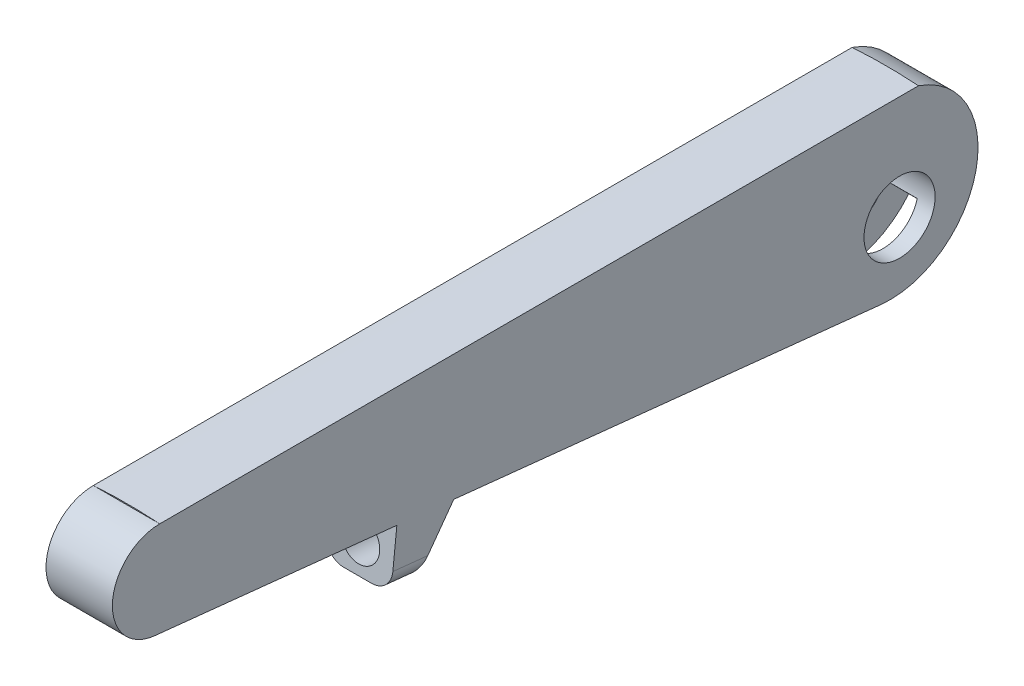
ISO-10303-21;
HEADER;
FILE_DESCRIPTION(('STEP AP214'),'2;1');
FILE_NAME('part.step','',(''),(''),'','','');
FILE_SCHEMA(('AUTOMOTIVE_DESIGN { 1 0 10303 214 1 1 1 1 }'));
ENDSEC;
DATA;
#1=APPLICATION_CONTEXT('core data for automotive mechanical design processes');
#2=APPLICATION_PROTOCOL_DEFINITION('international standard','automotive_design',2000,#1);
#3=PRODUCT_CONTEXT('',#1,'mechanical');
#4=PRODUCT('Part','Part','',(#3));
#5=PRODUCT_RELATED_PRODUCT_CATEGORY('part','',(#4));
#6=PRODUCT_DEFINITION_FORMATION('','',#4);
#7=PRODUCT_DEFINITION_CONTEXT('part definition',#1,'design');
#8=PRODUCT_DEFINITION('design','',#6,#7);
#9=PRODUCT_DEFINITION_SHAPE('','',#8);
#10=(LENGTH_UNIT() NAMED_UNIT(*) SI_UNIT(.MILLI.,.METRE.));
#11=(NAMED_UNIT(*) PLANE_ANGLE_UNIT() SI_UNIT($,.RADIAN.));
#12=(NAMED_UNIT(*) SI_UNIT($,.STERADIAN.) SOLID_ANGLE_UNIT());
#13=UNCERTAINTY_MEASURE_WITH_UNIT(LENGTH_MEASURE(1.E-05),#10,'distance_accuracy_value','');
#14=(GEOMETRIC_REPRESENTATION_CONTEXT(3) GLOBAL_UNCERTAINTY_ASSIGNED_CONTEXT((#13)) GLOBAL_UNIT_ASSIGNED_CONTEXT((#10,
#11,#12)) REPRESENTATION_CONTEXT('',''));
#15=CARTESIAN_POINT('',(0.,0.,0.));
#16=DIRECTION('',(0.,0.,1.));
#17=DIRECTION('',(1.,0.,0.));
#18=AXIS2_PLACEMENT_3D('',#15,#16,#17);
#19=CARTESIAN_POINT('',(-1.75,-6.15847799697525,-1.63160573692912));
#20=DIRECTION('',(0.,0.966650054379797,0.256100902707383));
#21=DIRECTION('',(0.,-0.256100902707383,0.966650054379797));
#22=AXIS2_PLACEMENT_3D('',#19,#20,#21);
#23=PLANE('',#22);
#24=DIRECTION('',(1.,0.,0.));
#25=VECTOR('',#24,1.);
#26=CARTESIAN_POINT('',(-1.75,-14.551376884929,30.0472992598035));
#27=LINE('',#26,#25);
#28=CARTESIAN_POINT('',(-1.75,-14.551376884929,30.0472992598035));
#29=VERTEX_POINT('',#28);
#30=CARTESIAN_POINT('',(1.75,-14.551376884929,30.0472992598035));
#31=VERTEX_POINT('',#30);
#32=EDGE_CURVE('E164',#29,#31,#27,.T.);
#33=ORIENTED_EDGE('',*,*,#32,.F.);
#34=DIRECTION('',(0.,-0.256100902707383,0.966650054379796));
#35=VECTOR('',#34,1.);
#36=CARTESIAN_POINT('',(-1.75,-6.15847799697525,-1.63160573692912));
#37=LINE('',#36,#35);
#38=CARTESIAN_POINT('',(-1.75,-7.37506229607576,2.96037838515269));
#39=VERTEX_POINT('',#38);
#40=EDGE_CURVE('E204',#39,#29,#37,.T.);
#41=ORIENTED_EDGE('',*,*,#40,.F.);
#42=DIRECTION('',(1.,0.,0.));
#43=VECTOR('',#42,1.);
#44=CARTESIAN_POINT('',(-1.75,-7.37506229607576,2.96037838515269));
#45=LINE('',#44,#43);
#46=CARTESIAN_POINT('',(1.75,-7.37506229607576,2.96037838515269));
#47=VERTEX_POINT('',#46);
#48=EDGE_CURVE('E217',#39,#47,#45,.T.);
#49=ORIENTED_EDGE('',*,*,#48,.T.);
#50=DIRECTION('',(0.,-0.256100902707383,0.966650054379796));
#51=VECTOR('',#50,1.);
#52=CARTESIAN_POINT('',(1.75,-6.15847799697525,-1.63160573692912));
#53=LINE('',#52,#51);
#54=EDGE_CURVE('E196',#47,#31,#53,.T.);
#55=ORIENTED_EDGE('',*,*,#54,.T.);
#56=EDGE_LOOP('',(#33,#41,#49,#55));
#57=FACE_BOUND('',#56,.T.);
#58=ADVANCED_FACE('F40',(#57),#23,.F.);
#59=CARTESIAN_POINT('',(-1.75,0.,0.));
#60=DIRECTION('',(1.,0.,0.));
#61=DIRECTION('',(0.,0.,-1.));
#62=AXIS2_PLACEMENT_3D('',#59,#60,#61);
#63=PLANE('',#62);
#64=ORIENTED_EDGE('',*,*,#40,.T.);
#65=DIRECTION('',(0.,0.104528463267647,0.994521895368274));
#66=VECTOR('',#65,1.);
#67=CARTESIAN_POINT('',(-1.75,-17.5159780329542,1.84100347608391));
#68=LINE('',#67,#66);
#69=CARTESIAN_POINT('',(-1.75,-15.9346529062823,16.8863070518606));
#70=VERTEX_POINT('',#69);
#71=EDGE_CURVE('E179',#70,#29,#68,.T.);
#72=ORIENTED_EDGE('',*,*,#71,.F.);
#73=DIRECTION('',(0.,0.994521895368274,-0.104528463267645));
#74=VECTOR('',#73,1.);
#75=CARTESIAN_POINT('',(-1.75,1.58132512667183,15.0453035757767));
#76=LINE('',#75,#74);
#77=CARTESIAN_POINT('',(-1.75,-16.6346529062823,16.9598800165466));
#78=VERTEX_POINT('',#77);
#79=EDGE_CURVE('E169',#78,#70,#76,.T.);
#80=ORIENTED_EDGE('',*,*,#79,.F.);
#81=DIRECTION('',(0.,-0.104528463267647,-0.994521895368274));
#82=VECTOR('',#81,1.);
#83=CARTESIAN_POINT('',(-1.75,-18.2159780329542,1.91457644076988));
#84=LINE('',#83,#82);
#85=CARTESIAN_POINT('',(-1.75,-18.,3.96947016040192));
#86=VERTEX_POINT('',#85);
#87=EDGE_CURVE('E193',#78,#86,#84,.T.);
#88=ORIENTED_EDGE('',*,*,#87,.T.);
#89=CARTESIAN_POINT('',(-1.75,-8.77610756644194,3.));
#90=DIRECTION('',(1.,0.,0.));
#91=DIRECTION('',(0.,0.,-1.));
#92=AXIS2_PLACEMENT_3D('',#89,#90,#91);
#93=CIRCLE('',#92,9.2747002117459);
#94=CARTESIAN_POINT('',(-1.75,-14.5967620873944,-4.22080639301978));
#95=VERTEX_POINT('',#94);
#96=EDGE_CURVE('E195',#86,#95,#93,.T.);
#97=ORIENTED_EDGE('',*,*,#96,.T.);
#98=DIRECTION('',(0.,-0.709093052308817,-0.705114914866623));
#99=VECTOR('',#98,1.);
#100=CARTESIAN_POINT('',(-1.75,-5.14695118388858,5.17598939990993));
#101=LINE('',#100,#99);
#102=CARTESIAN_POINT('',(-1.75,-11.9807567731744,-1.61947733131078));
#103=VERTEX_POINT('',#102);
#104=EDGE_CURVE('E199',#103,#95,#101,.T.);
#105=ORIENTED_EDGE('',*,*,#104,.F.);
#106=CARTESIAN_POINT('',(-1.75,-11.,2.));
#107=DIRECTION('',(1.,0.,0.));
#108=DIRECTION('',(0.,0.,-1.));
#109=AXIS2_PLACEMENT_3D('',#106,#107,#108);
#110=CIRCLE('',#109,3.75);
#111=EDGE_CURVE('E201',#39,#103,#110,.T.);
#112=ORIENTED_EDGE('',*,*,#111,.F.);
#113=EDGE_LOOP('',(#64,#72,#80,#88,#97,#105,#112));
#114=FACE_BOUND('',#113,.T.);
#115=ADVANCED_FACE('F350',(#114),#63,.T.);
#116=CARTESIAN_POINT('',(1.75,0.,0.));
#117=DIRECTION('',(1.,0.,0.));
#118=DIRECTION('',(0.,0.,-1.));
#119=AXIS2_PLACEMENT_3D('',#116,#117,#118);
#120=PLANE('',#119);
#121=DIRECTION('',(0.,-0.104528463267647,-0.994521895368274));
#122=VECTOR('',#121,1.);
#123=CARTESIAN_POINT('',(1.75,-17.5159780329542,1.84100347608391));
#124=LINE('',#123,#122);
#125=CARTESIAN_POINT('',(1.75,-15.9346529062823,16.8863070518606));
#126=VERTEX_POINT('',#125);
#127=EDGE_CURVE('E12',#31,#126,#124,.T.);
#128=ORIENTED_EDGE('',*,*,#127,.F.);
#129=ORIENTED_EDGE('',*,*,#54,.F.);
#130=CARTESIAN_POINT('',(1.75,-11.,2.));
#131=DIRECTION('',(1.,0.,0.));
#132=DIRECTION('',(0.,0.,-1.));
#133=AXIS2_PLACEMENT_3D('',#130,#131,#132);
#134=CIRCLE('',#133,3.75);
#135=CARTESIAN_POINT('',(1.75,-11.9807567731744,-1.61947733131078));
#136=VERTEX_POINT('',#135);
#137=EDGE_CURVE('E214',#47,#136,#134,.T.);
#138=ORIENTED_EDGE('',*,*,#137,.T.);
#139=DIRECTION('',(0.,-0.709093052308817,-0.705114914866623));
#140=VECTOR('',#139,1.);
#141=CARTESIAN_POINT('',(1.75,-5.14695118388858,5.17598939990993));
#142=LINE('',#141,#140);
#143=CARTESIAN_POINT('',(1.75,-14.5967620873944,-4.22080639301978));
#144=VERTEX_POINT('',#143);
#145=EDGE_CURVE('E212',#136,#144,#142,.T.);
#146=ORIENTED_EDGE('',*,*,#145,.T.);
#147=CARTESIAN_POINT('',(1.75,-8.77610756644194,3.));
#148=DIRECTION('',(1.,0.,0.));
#149=DIRECTION('',(0.,0.,-1.));
#150=AXIS2_PLACEMENT_3D('',#147,#148,#149);
#151=CIRCLE('',#150,9.2747002117459);
#152=CARTESIAN_POINT('',(1.75,-18.,3.96947016040192));
#153=VERTEX_POINT('',#152);
#154=EDGE_CURVE('E209',#153,#144,#151,.T.);
#155=ORIENTED_EDGE('',*,*,#154,.F.);
#156=DIRECTION('',(0.,-0.104528463267647,-0.994521895368274));
#157=VECTOR('',#156,1.);
#158=CARTESIAN_POINT('',(1.75,-18.2159780329542,1.91457644076988));
#159=LINE('',#158,#157);
#160=CARTESIAN_POINT('',(1.75,-16.6346529062823,16.9598800165466));
#161=VERTEX_POINT('',#160);
#162=EDGE_CURVE('E175',#161,#153,#159,.T.);
#163=ORIENTED_EDGE('',*,*,#162,.F.);
#164=DIRECTION('',(0.,-0.994521895368274,0.104528463267645));
#165=VECTOR('',#164,1.);
#166=CARTESIAN_POINT('',(1.75,1.58132512667183,15.0453035757767));
#167=LINE('',#166,#165);
#168=EDGE_CURVE('E55',#126,#161,#167,.T.);
#169=ORIENTED_EDGE('',*,*,#168,.F.);
#170=EDGE_LOOP('',(#128,#129,#138,#146,#155,#163,#169));
#171=FACE_BOUND('',#170,.T.);
#172=ADVANCED_FACE('F173',(#171),#120,.F.);
#173=CARTESIAN_POINT('',(3.5,-18.2159780329542,1.91457644076988));
#174=DIRECTION('',(0.,0.994521895368274,-0.104528463267647));
#175=DIRECTION('',(0.,0.104528463267647,0.994521895368274));
#176=AXIS2_PLACEMENT_3D('',#173,#174,#175);
#177=PLANE('',#176);
#178=ORIENTED_EDGE('',*,*,#87,.F.);
#179=DIRECTION('',(1.,0.,0.));
#180=VECTOR('',#179,1.);
#181=CARTESIAN_POINT('',(-16.9945184713462,-16.6346529062823,16.9598800165466));
#182=LINE('',#181,#180);
#183=EDGE_CURVE('E170',#78,#161,#182,.T.);
#184=ORIENTED_EDGE('',*,*,#183,.T.);
#185=ORIENTED_EDGE('',*,*,#162,.T.);
#186=DIRECTION('',(-1.,0.,0.));
#187=VECTOR('',#186,1.);
#188=CARTESIAN_POINT('',(3.5,-18.,3.96947016040192));
#189=LINE('',#188,#187);
#190=CARTESIAN_POINT('',(3.5,-18.,3.96947016040192));
#191=VERTEX_POINT('',#190);
#192=EDGE_CURVE('E271',#191,#153,#189,.T.);
#193=ORIENTED_EDGE('',*,*,#192,.F.);
#194=DIRECTION('',(0.,-0.104528463267647,-0.994521895368274));
#195=VECTOR('',#194,1.);
#196=CARTESIAN_POINT('',(3.5,-18.2159780329542,1.91457644076988));
#197=LINE('',#196,#195);
#198=CARTESIAN_POINT('',(3.5,-13.2671005976011,49.));
#199=VERTEX_POINT('',#198);
#200=EDGE_CURVE('E234',#199,#191,#197,.T.);
#201=ORIENTED_EDGE('',*,*,#200,.F.);
#202=DIRECTION('',(-1.,0.,0.));
#203=VECTOR('',#202,1.);
#204=CARTESIAN_POINT('',(3.5,-13.2671005976011,49.));
#205=LINE('',#204,#203);
#206=CARTESIAN_POINT('',(-3.5,-13.2671005976011,49.));
#207=VERTEX_POINT('',#206);
#208=EDGE_CURVE('E274',#199,#207,#205,.T.);
#209=ORIENTED_EDGE('',*,*,#208,.T.);
#210=DIRECTION('',(0.,-0.104528463267647,-0.994521895368274));
#211=VECTOR('',#210,1.);
#212=CARTESIAN_POINT('',(-3.5,-18.2159780329542,1.91457644076988));
#213=LINE('',#212,#211);
#214=CARTESIAN_POINT('',(-3.5,-18.,3.96947016040192));
#215=VERTEX_POINT('',#214);
#216=EDGE_CURVE('E251',#207,#215,#213,.T.);
#217=ORIENTED_EDGE('',*,*,#216,.T.);
#218=EDGE_CURVE('E270',#86,#215,#189,.T.);
#219=ORIENTED_EDGE('',*,*,#218,.F.);
#220=EDGE_LOOP('',(#178,#184,#185,#193,#201,#209,#217,#219));
#221=FACE_BOUND('',#220,.T.);
#222=ADVANCED_FACE('F318',(#221),#177,.F.);
#223=CARTESIAN_POINT('',(3.5,-8.77610756644194,3.));
#224=DIRECTION('',(-1.,0.,0.));
#225=DIRECTION('',(0.,0.,1.));
#226=AXIS2_PLACEMENT_3D('',#223,#224,#225);
#227=CYLINDRICAL_SURFACE('',#226,9.2747002117459);
#228=ORIENTED_EDGE('',*,*,#96,.F.);
#229=ORIENTED_EDGE('',*,*,#218,.T.);
#230=CARTESIAN_POINT('',(-3.5,-8.77610756644194,3.));
#231=DIRECTION('',(1.,0.,0.));
#232=DIRECTION('',(0.,0.,-1.));
#233=AXIS2_PLACEMENT_3D('',#230,#231,#232);
#234=CIRCLE('',#233,9.2747002117459);
#235=CARTESIAN_POINT('',(-3.5,0.,0.));
#236=VERTEX_POINT('',#235);
#237=EDGE_CURVE('E256',#215,#236,#234,.T.);
#238=ORIENTED_EDGE('',*,*,#237,.T.);
#239=DIRECTION('',(-1.,0.,0.));
#240=VECTOR('',#239,1.);
#241=CARTESIAN_POINT('',(3.5,0.,0.));
#242=LINE('',#241,#240);
#243=CARTESIAN_POINT('',(3.5,0.,0.));
#244=VERTEX_POINT('',#243);
#245=EDGE_CURVE('E267',#244,#236,#242,.T.);
#246=ORIENTED_EDGE('',*,*,#245,.F.);
#247=CARTESIAN_POINT('',(3.5,-8.77610756644194,3.));
#248=DIRECTION('',(1.,0.,0.));
#249=DIRECTION('',(0.,0.,-1.));
#250=AXIS2_PLACEMENT_3D('',#247,#248,#249);
#251=CIRCLE('',#250,9.2747002117459);
#252=EDGE_CURVE('E238',#191,#244,#251,.T.);
#253=ORIENTED_EDGE('',*,*,#252,.F.);
#254=ORIENTED_EDGE('',*,*,#192,.T.);
#255=ORIENTED_EDGE('',*,*,#154,.T.);
#256=DIRECTION('',(1.,0.,0.));
#257=VECTOR('',#256,1.);
#258=CARTESIAN_POINT('',(-1.75,-14.5967620873944,-4.22080639301978));
#259=LINE('',#258,#257);
#260=EDGE_CURVE('E207',#95,#144,#259,.T.);
#261=ORIENTED_EDGE('',*,*,#260,.F.);
#262=EDGE_LOOP('',(#228,#229,#238,#246,#253,#254,#255,#261));
#263=FACE_BOUND('',#262,.T.);
#264=ADVANCED_FACE('F325',(#263),#227,.T.);
#265=CARTESIAN_POINT('',(3.5,-11.,2.));
#266=DIRECTION('',(-1.,0.,0.));
#267=DIRECTION('',(0.,0.,1.));
#268=AXIS2_PLACEMENT_3D('',#265,#266,#267);
#269=CYLINDRICAL_SURFACE('',#268,3.75);
#270=CARTESIAN_POINT('',(3.5,-11.,2.));
#271=DIRECTION('',(1.,0.,0.));
#272=DIRECTION('',(0.,0.,-1.));
#273=AXIS2_PLACEMENT_3D('',#270,#271,#272);
#274=CIRCLE('',#273,3.75);
#275=CARTESIAN_POINT('',(3.5,-11.,-1.75));
#276=VERTEX_POINT('',#275);
#277=EDGE_CURVE('E226',#276,#276,#274,.T.);
#278=ORIENTED_EDGE('',*,*,#277,.T.);
#279=EDGE_LOOP('',(#278));
#280=FACE_BOUND('',#279,.T.);
#281=CARTESIAN_POINT('',(-3.5,-11.,2.));
#282=DIRECTION('',(1.,0.,0.));
#283=DIRECTION('',(0.,0.,-1.));
#284=AXIS2_PLACEMENT_3D('',#281,#282,#283);
#285=CIRCLE('',#284,3.75);
#286=CARTESIAN_POINT('',(-3.5,-11.,-1.75));
#287=VERTEX_POINT('',#286);
#288=EDGE_CURVE('E220',#287,#287,#285,.T.);
#289=ORIENTED_EDGE('',*,*,#288,.F.);
#290=EDGE_LOOP('',(#289));
#291=FACE_BOUND('',#290,.T.);
#292=ORIENTED_EDGE('',*,*,#48,.F.);
#293=ORIENTED_EDGE('',*,*,#111,.T.);
#294=DIRECTION('',(1.,0.,0.));
#295=VECTOR('',#294,1.);
#296=CARTESIAN_POINT('',(-1.75,-11.9807567731744,-1.61947733131078));
#297=LINE('',#296,#295);
#298=EDGE_CURVE('E221',#103,#136,#297,.T.);
#299=ORIENTED_EDGE('',*,*,#298,.T.);
#300=ORIENTED_EDGE('',*,*,#137,.F.);
#301=EDGE_LOOP('',(#292,#293,#299,#300));
#302=FACE_BOUND('',#301,.T.);
#303=ADVANCED_FACE('F377',(#280,#291,#302),#269,.F.);
#304=CARTESIAN_POINT('',(-3.5,-9.95403967107079,80.5216691140561));
#305=VERTEX_POINT('',#304);
#306=CARTESIAN_POINT('',(-3.5,-12.6364751860071,55.));
#307=VERTEX_POINT('',#306);
#308=EDGE_CURVE('E247',#305,#307,#213,.T.);
#309=ORIENTED_EDGE('',*,*,#308,.T.);
#310=DIRECTION('',(-1.,0.,0.));
#311=VECTOR('',#310,1.);
#312=CARTESIAN_POINT('',(3.5,-12.6364751860071,55.));
#313=LINE('',#312,#311);
#314=CARTESIAN_POINT('',(3.5,-12.6364751860071,55.));
#315=VERTEX_POINT('',#314);
#316=EDGE_CURVE('E283',#315,#307,#313,.T.);
#317=ORIENTED_EDGE('',*,*,#316,.F.);
#318=CARTESIAN_POINT('',(3.5,-9.95403967107079,80.5216691140561));
#319=VERTEX_POINT('',#318);
#320=EDGE_CURVE('E229',#319,#315,#197,.T.);
#321=ORIENTED_EDGE('',*,*,#320,.F.);
#322=DIRECTION('',(-1.,0.,0.));
#323=VECTOR('',#322,1.);
#324=CARTESIAN_POINT('',(3.5,-9.95403967107079,80.5216691140561));
#325=LINE('',#324,#323);
#326=EDGE_CURVE('E244',#319,#305,#325,.T.);
#327=ORIENTED_EDGE('',*,*,#326,.T.);
#328=EDGE_LOOP('',(#309,#317,#321,#327));
#329=FACE_BOUND('',#328,.T.);
#330=ADVANCED_FACE('F380',(#329),#177,.F.);
#331=CARTESIAN_POINT('',(3.5,5.57950284694705,53.0854235592301));
#332=DIRECTION('',(0.,-0.104528463267647,-0.994521895368274));
#333=DIRECTION('',(0.,0.994521895368274,-0.104528463267647));
#334=AXIS2_PLACEMENT_3D('',#331,#332,#333);
#335=PLANE('',#334);
#336=CARTESIAN_POINT('',(0.,-15.6529094999023,55.3170400217911));
#337=DIRECTION('',(0.,0.104528463267647,0.994521895368274));
#338=DIRECTION('',(0.,-0.994521895368274,0.104528463267647));
#339=AXIS2_PLACEMENT_3D('',#336,#337,#338);
#340=CIRCLE('',#339,2.);
#341=CARTESIAN_POINT('',(0.,-17.6419532906388,55.5260969483264));
#342=VERTEX_POINT('',#341);
#343=EDGE_CURVE('E183',#342,#342,#340,.T.);
#344=ORIENTED_EDGE('',*,*,#343,.F.);
#345=EDGE_LOOP('',(#344));
#346=FACE_BOUND('',#345,.T.);
#347=DIRECTION('',(0.,-0.994521895368274,0.104528463267647));
#348=VECTOR('',#347,1.);
#349=CARTESIAN_POINT('',(-3.5,5.57950284694705,53.0854235592301));
#350=LINE('',#349,#348);
#351=CARTESIAN_POINT('',(-3.5,-16.6474313952706,55.4215684850587));
#352=VERTEX_POINT('',#351);
#353=EDGE_CURVE('E250',#307,#352,#350,.T.);
#354=ORIENTED_EDGE('',*,*,#353,.T.);
#355=CARTESIAN_POINT('',(-1.5,-16.6474313952706,55.4215684850587));
#356=DIRECTION('',(0.,-0.104528463267647,-0.994521895368274));
#357=DIRECTION('',(0.,0.994521895368274,-0.104528463267647));
#358=AXIS2_PLACEMENT_3D('',#355,#356,#357);
#359=CIRCLE('',#358,2.);
#360=CARTESIAN_POINT('',(-1.5,-18.6364751860071,55.630625411594));
#361=VERTEX_POINT('',#360);
#362=EDGE_CURVE('E300',#352,#361,#359,.F.);
#363=ORIENTED_EDGE('',*,*,#362,.T.);
#364=DIRECTION('',(-1.,0.,0.));
#365=VECTOR('',#364,1.);
#366=CARTESIAN_POINT('',(3.5,-18.6364751860071,55.630625411594));
#367=LINE('',#366,#365);
#368=CARTESIAN_POINT('',(1.5,-18.6364751860071,55.630625411594));
#369=VERTEX_POINT('',#368);
#370=EDGE_CURVE('E280',#369,#361,#367,.T.);
#371=ORIENTED_EDGE('',*,*,#370,.F.);
#372=CARTESIAN_POINT('',(1.5,-16.6474313952706,55.4215684850587));
#373=DIRECTION('',(0.,-0.104528463267647,-0.994521895368274));
#374=DIRECTION('',(0.,0.994521895368274,-0.104528463267647));
#375=AXIS2_PLACEMENT_3D('',#372,#373,#374);
#376=CIRCLE('',#375,2.);
#377=CARTESIAN_POINT('',(3.5,-16.6474313952706,55.4215684850587));
#378=VERTEX_POINT('',#377);
#379=EDGE_CURVE('E63',#369,#378,#376,.F.);
#380=ORIENTED_EDGE('',*,*,#379,.T.);
#381=DIRECTION('',(0.,-0.994521895368274,0.104528463267647));
#382=VECTOR('',#381,1.);
#383=CARTESIAN_POINT('',(3.5,5.57950284694705,53.0854235592301));
#384=LINE('',#383,#382);
#385=EDGE_CURVE('E233',#315,#378,#384,.T.);
#386=ORIENTED_EDGE('',*,*,#385,.F.);
#387=ORIENTED_EDGE('',*,*,#316,.T.);
#388=EDGE_LOOP('',(#354,#363,#371,#380,#386,#387));
#389=FACE_BOUND('',#388,.T.);
#390=ADVANCED_FACE('F387',(#346,#389),#335,.F.);
#391=CARTESIAN_POINT('',(3.5,-24.2159780329541,2.54520185236388));
#392=DIRECTION('',(0.,0.994521895368274,-0.104528463267646));
#393=DIRECTION('',(0.,0.104528463267646,0.994521895368274));
#394=AXIS2_PLACEMENT_3D('',#391,#392,#393);
#395=PLANE('',#394);
#396=ORIENTED_EDGE('',*,*,#370,.T.);
#397=DIRECTION('',(0.,-0.104528463267646,-0.994521895368274));
#398=VECTOR('',#397,1.);
#399=CARTESIAN_POINT('',(-1.5,-24.2159780329541,2.54520185236388));
#400=LINE('',#399,#398);
#401=CARTESIAN_POINT('',(-1.5,-18.9030088464595,53.0947270267318));
#402=VERTEX_POINT('',#401);
#403=EDGE_CURVE('E290',#361,#402,#400,.T.);
#404=ORIENTED_EDGE('',*,*,#403,.T.);
#405=DIRECTION('',(-1.,0.,0.));
#406=VECTOR('',#405,1.);
#407=CARTESIAN_POINT('',(3.5,-18.9030088464595,53.0947270267318));
#408=LINE('',#407,#406);
#409=CARTESIAN_POINT('',(1.5,-18.9030088464595,53.0947270267318));
#410=VERTEX_POINT('',#409);
#411=EDGE_CURVE('E277',#410,#402,#408,.T.);
#412=ORIENTED_EDGE('',*,*,#411,.F.);
#413=DIRECTION('',(0.,-0.104528463267646,-0.994521895368274));
#414=VECTOR('',#413,1.);
#415=CARTESIAN_POINT('',(1.5,-18.6364751860071,55.630625411594));
#416=LINE('',#415,#414);
#417=EDGE_CURVE('E286',#410,#369,#416,.F.);
#418=ORIENTED_EDGE('',*,*,#417,.T.);
#419=EDGE_LOOP('',(#396,#404,#412,#418));
#420=FACE_BOUND('',#419,.T.);
#421=ADVANCED_FACE('F383',(#420),#395,.F.);
#422=CARTESIAN_POINT('',(3.5,18.7172141258011,25.7620351243408));
#423=DIRECTION('',(0.,0.587785252292465,0.809016994374953));
#424=DIRECTION('',(0.,-0.809016994374953,0.587785252292465));
#425=AXIS2_PLACEMENT_3D('',#422,#423,#424);
#426=PLANE('',#425);
#427=CARTESIAN_POINT('',(0.,-16.1004917695713,51.0585791849113));
#428=DIRECTION('',(0.,0.587785252292465,0.809016994374953));
#429=DIRECTION('',(0.,-0.809016994374953,0.587785252292465));
#430=AXIS2_PLACEMENT_3D('',#427,#428,#429);
#431=ELLIPSE('',#430,2.3094010767585,2.);
#432=CARTESIAN_POINT('',(0.,-17.9688364874968,52.4160110794583));
#433=VERTEX_POINT('',#432);
#434=EDGE_CURVE('E186',#433,#433,#431,.T.);
#435=ORIENTED_EDGE('',*,*,#434,.T.);
#436=EDGE_LOOP('',(#435));
#437=FACE_BOUND('',#436,.T.);
#438=ORIENTED_EDGE('',*,*,#411,.T.);
#439=CARTESIAN_POINT('',(-1.5,-17.0346641285341,51.7372951321848));
#440=DIRECTION('',(0.,0.587785252292465,0.809016994374953));
#441=DIRECTION('',(0.,0.809016994374953,-0.587785252292465));
#442=AXIS2_PLACEMENT_3D('',#439,#440,#441);
#443=ELLIPSE('',#442,2.3094010767585,2.);
#444=CARTESIAN_POINT('',(-3.5,-17.0346641285341,51.7372951321848));
#445=VERTEX_POINT('',#444);
#446=EDGE_CURVE('E295',#402,#445,#443,.F.);
#447=ORIENTED_EDGE('',*,*,#446,.T.);
#448=DIRECTION('',(0.,0.809016994374953,-0.587785252292465));
#449=VECTOR('',#448,1.);
#450=CARTESIAN_POINT('',(-3.5,18.7172141258011,25.7620351243408));
#451=LINE('',#450,#449);
#452=EDGE_CURVE('E254',#445,#207,#451,.T.);
#453=ORIENTED_EDGE('',*,*,#452,.T.);
#454=ORIENTED_EDGE('',*,*,#208,.F.);
#455=DIRECTION('',(0.,0.809016994374953,-0.587785252292465));
#456=VECTOR('',#455,1.);
#457=CARTESIAN_POINT('',(3.5,18.7172141258011,25.7620351243408));
#458=LINE('',#457,#456);
#459=CARTESIAN_POINT('',(3.5,-17.0346641285341,51.7372951321848));
#460=VERTEX_POINT('',#459);
#461=EDGE_CURVE('E236',#460,#199,#458,.T.);
#462=ORIENTED_EDGE('',*,*,#461,.F.);
#463=CARTESIAN_POINT('',(1.5,-17.0346641285341,51.7372951321848));
#464=DIRECTION('',(0.,0.587785252292465,0.809016994374953));
#465=DIRECTION('',(0.,-0.809016994374953,0.587785252292465));
#466=AXIS2_PLACEMENT_3D('',#463,#464,#465);
#467=ELLIPSE('',#466,2.3094010767585,2.);
#468=EDGE_CURVE('E293',#460,#410,#467,.F.);
#469=ORIENTED_EDGE('',*,*,#468,.T.);
#470=EDGE_LOOP('',(#438,#447,#453,#454,#462,#469));
#471=FACE_BOUND('',#470,.T.);
#472=ADVANCED_FACE('F309',(#437,#471),#426,.F.);
#473=CARTESIAN_POINT('',(3.5,-4.99068959542951,80.));
#474=DIRECTION('',(-1.,0.,0.));
#475=DIRECTION('',(0.,0.,1.));
#476=AXIS2_PLACEMENT_3D('',#473,#474,#475);
#477=CYLINDRICAL_SURFACE('',#476,4.99068959542951);
#478=CARTESIAN_POINT('',(-3.5,-4.99068959542951,80.));
#479=DIRECTION('',(1.,0.,0.));
#480=DIRECTION('',(0.,0.,-1.));
#481=AXIS2_PLACEMENT_3D('',#478,#479,#480);
#482=CIRCLE('',#481,4.99068959542951);
#483=CARTESIAN_POINT('',(-3.5,0.,80.));
#484=VERTEX_POINT('',#483);
#485=EDGE_CURVE('E230',#484,#305,#482,.T.);
#486=ORIENTED_EDGE('',*,*,#485,.T.);
#487=ORIENTED_EDGE('',*,*,#326,.F.);
#488=CARTESIAN_POINT('',(3.5,-4.99068959542951,80.));
#489=DIRECTION('',(1.,0.,0.));
#490=DIRECTION('',(0.,0.,-1.));
#491=AXIS2_PLACEMENT_3D('',#488,#489,#490);
#492=CIRCLE('',#491,4.99068959542951);
#493=CARTESIAN_POINT('',(3.5,0.,80.));
#494=VERTEX_POINT('',#493);
#495=EDGE_CURVE('E242',#494,#319,#492,.T.);
#496=ORIENTED_EDGE('',*,*,#495,.F.);
#497=DIRECTION('',(-1.,0.,0.));
#498=VECTOR('',#497,1.);
#499=CARTESIAN_POINT('',(3.5,0.,80.));
#500=LINE('',#499,#498);
#501=EDGE_CURVE('E264',#494,#484,#500,.T.);
#502=ORIENTED_EDGE('',*,*,#501,.T.);
#503=EDGE_LOOP('',(#486,#487,#496,#502));
#504=FACE_BOUND('',#503,.T.);
#505=ADVANCED_FACE('F367',(#504),#477,.T.);
#506=CARTESIAN_POINT('',(3.5,0.,0.));
#507=DIRECTION('',(1.,0.,0.));
#508=DIRECTION('',(0.,0.,-1.));
#509=AXIS2_PLACEMENT_3D('',#506,#507,#508);
#510=PLANE('',#509);
#511=ORIENTED_EDGE('',*,*,#277,.F.);
#512=EDGE_LOOP('',(#511));
#513=FACE_BOUND('',#512,.T.);
#514=ORIENTED_EDGE('',*,*,#385,.T.);
#515=DIRECTION('',(0.,-0.104528463267646,-0.994521895368274));
#516=VECTOR('',#515,1.);
#517=CARTESIAN_POINT('',(3.5,-16.913965055723,52.8856701001965));
#518=LINE('',#517,#516);
#519=EDGE_CURVE('E48',#378,#460,#518,.T.);
#520=ORIENTED_EDGE('',*,*,#519,.T.);
#521=ORIENTED_EDGE('',*,*,#461,.T.);
#522=ORIENTED_EDGE('',*,*,#200,.T.);
#523=ORIENTED_EDGE('',*,*,#252,.T.);
#524=DIRECTION('',(0.,0.,1.));
#525=VECTOR('',#524,1.);
#526=CARTESIAN_POINT('',(3.5,0.,0.));
#527=LINE('',#526,#525);
#528=EDGE_CURVE('E240',#244,#494,#527,.T.);
#529=ORIENTED_EDGE('',*,*,#528,.T.);
#530=ORIENTED_EDGE('',*,*,#495,.T.);
#531=ORIENTED_EDGE('',*,*,#320,.T.);
#532=EDGE_LOOP('',(#514,#520,#521,#522,#523,#529,#530,#531));
#533=FACE_BOUND('',#532,.T.);
#534=ADVANCED_FACE('F305',(#513,#533),#510,.T.);
#535=CARTESIAN_POINT('',(-3.5,0.,0.));
#536=DIRECTION('',(1.,0.,0.));
#537=DIRECTION('',(0.,0.,-1.));
#538=AXIS2_PLACEMENT_3D('',#535,#536,#537);
#539=PLANE('',#538);
#540=ORIENTED_EDGE('',*,*,#288,.T.);
#541=EDGE_LOOP('',(#540));
#542=FACE_BOUND('',#541,.T.);
#543=ORIENTED_EDGE('',*,*,#452,.F.);
#544=DIRECTION('',(0.,-0.104528463267646,-0.994521895368274));
#545=VECTOR('',#544,1.);
#546=CARTESIAN_POINT('',(-3.5,-22.2269342422176,2.33614492582859));
#547=LINE('',#546,#545);
#548=EDGE_CURVE('E297',#445,#352,#547,.F.);
#549=ORIENTED_EDGE('',*,*,#548,.T.);
#550=ORIENTED_EDGE('',*,*,#353,.F.);
#551=ORIENTED_EDGE('',*,*,#308,.F.);
#552=ORIENTED_EDGE('',*,*,#485,.F.);
#553=DIRECTION('',(0.,0.,1.));
#554=VECTOR('',#553,1.);
#555=CARTESIAN_POINT('',(-3.5,0.,0.));
#556=LINE('',#555,#554);
#557=EDGE_CURVE('E258',#236,#484,#556,.T.);
#558=ORIENTED_EDGE('',*,*,#557,.F.);
#559=ORIENTED_EDGE('',*,*,#237,.F.);
#560=ORIENTED_EDGE('',*,*,#216,.F.);
#561=EDGE_LOOP('',(#543,#549,#550,#551,#552,#558,#559,#560));
#562=FACE_BOUND('',#561,.T.);
#563=ADVANCED_FACE('F363',(#542,#562),#539,.F.);
#564=CARTESIAN_POINT('',(-1.75,-5.14695118388858,5.17598939990993));
#565=DIRECTION('',(0.,-0.705114914866623,0.709093052308817));
#566=DIRECTION('',(0.,-0.709093052308817,-0.705114914866623));
#567=AXIS2_PLACEMENT_3D('',#564,#565,#566);
#568=PLANE('',#567);
#569=ORIENTED_EDGE('',*,*,#145,.F.);
#570=ORIENTED_EDGE('',*,*,#298,.F.);
#571=ORIENTED_EDGE('',*,*,#104,.T.);
#572=ORIENTED_EDGE('',*,*,#260,.T.);
#573=EDGE_LOOP('',(#569,#570,#571,#572));
#574=FACE_BOUND('',#573,.T.);
#575=ADVANCED_FACE('F360',(#574),#568,.T.);
#576=CARTESIAN_POINT('',(0.,-50.6792857092521,80.));
#577=DIRECTION('',(0.,0.,-1.));
#578=DIRECTION('',(-1.,0.,0.));
#579=AXIS2_PLACEMENT_3D('',#576,#577,#578);
#580=CYLINDRICAL_SURFACE('',#579,50.8);
#581=CARTESIAN_POINT('',(0.,-50.6792857092521,0.));
#582=DIRECTION('',(0.,0.,1.));
#583=DIRECTION('',(1.,0.,0.));
#584=AXIS2_PLACEMENT_3D('',#581,#582,#583);
#585=CIRCLE('',#584,50.8);
#586=EDGE_CURVE('E190',#244,#236,#585,.T.);
#587=ORIENTED_EDGE('',*,*,#586,.T.);
#588=ORIENTED_EDGE('',*,*,#557,.T.);
#589=CARTESIAN_POINT('',(0.,-50.6792857092521,80.));
#590=DIRECTION('',(0.,0.,1.));
#591=DIRECTION('',(1.,0.,0.));
#592=AXIS2_PLACEMENT_3D('',#589,#590,#591);
#593=CIRCLE('',#592,50.8);
#594=EDGE_CURVE('E187',#494,#484,#593,.T.);
#595=ORIENTED_EDGE('',*,*,#594,.F.);
#596=ORIENTED_EDGE('',*,*,#528,.F.);
#597=EDGE_LOOP('',(#587,#588,#595,#596));
#598=FACE_BOUND('',#597,.T.);
#599=ADVANCED_FACE('F332',(#598),#580,.T.);
#600=CARTESIAN_POINT('',(0.,0.,80.));
#601=DIRECTION('',(0.,0.,1.));
#602=DIRECTION('',(1.,0.,0.));
#603=AXIS2_PLACEMENT_3D('',#600,#601,#602);
#604=PLANE('',#603);
#605=ORIENTED_EDGE('',*,*,#501,.F.);
#606=ORIENTED_EDGE('',*,*,#594,.T.);
#607=EDGE_LOOP('',(#605,#606));
#608=FACE_BOUND('',#607,.T.);
#609=ADVANCED_FACE('F337',(#608),#604,.T.);
#610=CARTESIAN_POINT('',(0.,0.,0.));
#611=DIRECTION('',(0.,0.,1.));
#612=DIRECTION('',(1.,0.,0.));
#613=AXIS2_PLACEMENT_3D('',#610,#611,#612);
#614=PLANE('',#613);
#615=ORIENTED_EDGE('',*,*,#245,.T.);
#616=ORIENTED_EDGE('',*,*,#586,.F.);
#617=EDGE_LOOP('',(#615,#616));
#618=FACE_BOUND('',#617,.T.);
#619=ADVANCED_FACE('F334',(#618),#614,.F.);
#620=CARTESIAN_POINT('',(0.,-16.3846087427758,48.3553867542132));
#621=DIRECTION('',(0.,0.104528463267647,0.994521895368274));
#622=DIRECTION('',(0.,-0.994521895368274,0.104528463267647));
#623=AXIS2_PLACEMENT_3D('',#620,#621,#622);
#624=CYLINDRICAL_SURFACE('',#623,2.);
#625=ORIENTED_EDGE('',*,*,#343,.T.);
#626=EDGE_LOOP('',(#625));
#627=FACE_BOUND('',#626,.T.);
#628=ORIENTED_EDGE('',*,*,#434,.F.);
#629=EDGE_LOOP('',(#628));
#630=FACE_BOUND('',#629,.T.);
#631=ADVANCED_FACE('F336',(#627,#630),#624,.F.);
#632=CARTESIAN_POINT('',(-1.5,-22.2269342422176,2.33614492582859));
#633=DIRECTION('',(0.,-0.104528463267646,-0.994521895368274));
#634=DIRECTION('',(0.,0.994521895368274,-0.104528463267646));
#635=AXIS2_PLACEMENT_3D('',#632,#633,#634);
#636=CYLINDRICAL_SURFACE('',#635,2.);
#637=ORIENTED_EDGE('',*,*,#362,.F.);
#638=ORIENTED_EDGE('',*,*,#548,.F.);
#639=ORIENTED_EDGE('',*,*,#446,.F.);
#640=ORIENTED_EDGE('',*,*,#403,.F.);
#641=EDGE_LOOP('',(#637,#638,#639,#640));
#642=FACE_BOUND('',#641,.T.);
#643=ADVANCED_FACE('F343',(#642),#636,.T.);
#644=CARTESIAN_POINT('',(1.5,-22.2269342422176,2.33614492582859));
#645=DIRECTION('',(0.,0.104528463267646,0.994521895368274));
#646=DIRECTION('',(0.,-0.994521895368274,0.104528463267646));
#647=AXIS2_PLACEMENT_3D('',#644,#645,#646);
#648=CYLINDRICAL_SURFACE('',#647,2.);
#649=ORIENTED_EDGE('',*,*,#379,.F.);
#650=ORIENTED_EDGE('',*,*,#417,.F.);
#651=ORIENTED_EDGE('',*,*,#468,.F.);
#652=ORIENTED_EDGE('',*,*,#519,.F.);
#653=EDGE_LOOP('',(#649,#650,#651,#652));
#654=FACE_BOUND('',#653,.T.);
#655=ADVANCED_FACE('F42',(#654),#648,.T.);
#656=CARTESIAN_POINT('',(-16.9945184713462,-17.5159780329542,1.84100347608391));
#657=DIRECTION('',(0.,-0.994521895368274,0.104528463267647));
#658=DIRECTION('',(0.,-0.104528463267647,-0.994521895368274));
#659=AXIS2_PLACEMENT_3D('',#656,#657,#658);
#660=PLANE('',#659);
#661=ORIENTED_EDGE('',*,*,#71,.T.);
#662=ORIENTED_EDGE('',*,*,#32,.T.);
#663=ORIENTED_EDGE('',*,*,#127,.T.);
#664=DIRECTION('',(1.,0.,0.));
#665=VECTOR('',#664,1.);
#666=CARTESIAN_POINT('',(-16.9945184713462,-15.9346529062823,16.8863070518606));
#667=LINE('',#666,#665);
#668=EDGE_CURVE('E161',#70,#126,#667,.T.);
#669=ORIENTED_EDGE('',*,*,#668,.F.);
#670=EDGE_LOOP('',(#661,#662,#663,#669));
#671=FACE_BOUND('',#670,.T.);
#672=ADVANCED_FACE('F160',(#671),#660,.F.);
#673=CARTESIAN_POINT('',(-16.9945184713462,1.58132512667183,15.0453035757767));
#674=DIRECTION('',(0.,0.104528463267645,0.994521895368274));
#675=DIRECTION('',(0.,-0.994521895368274,0.104528463267645));
#676=AXIS2_PLACEMENT_3D('',#673,#674,#675);
#677=PLANE('',#676);
#678=ORIENTED_EDGE('',*,*,#183,.F.);
#679=ORIENTED_EDGE('',*,*,#79,.T.);
#680=ORIENTED_EDGE('',*,*,#668,.T.);
#681=ORIENTED_EDGE('',*,*,#168,.T.);
#682=EDGE_LOOP('',(#678,#679,#680,#681));
#683=FACE_BOUND('',#682,.T.);
#684=ADVANCED_FACE('F167',(#683),#677,.F.);
#685=CLOSED_SHELL('',(#58,#115,#172,#222,#264,#303,#330,#390,#421,#472,#505,#534,#563,#575,#599,
#609,#619,#631,#643,#655,#672,#684));
#686=MANIFOLD_SOLID_BREP('B2',#685);
#687=ADVANCED_BREP_SHAPE_REPRESENTATION('',(#18,#686),#14);
#688=SHAPE_DEFINITION_REPRESENTATION(#9,#687);
ENDSEC;
END-ISO-10303-21;
